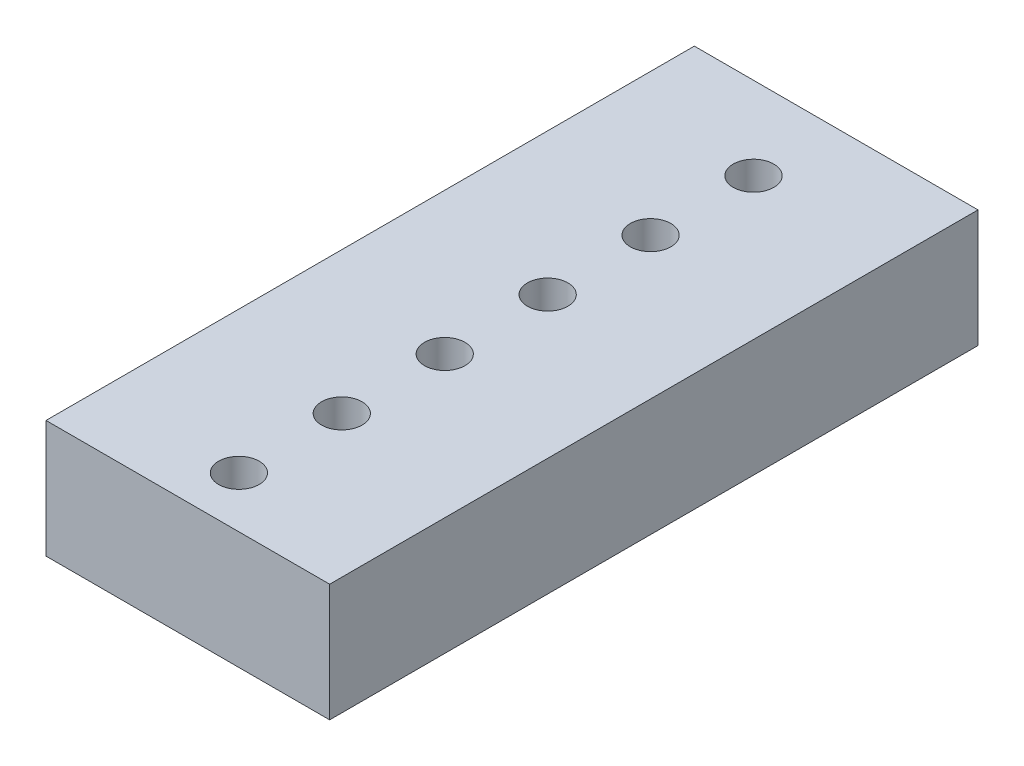
ISO-10303-21;
HEADER;
FILE_DESCRIPTION(('STEP AP214'),'2;1');
FILE_NAME('part.step','',(''),(''),'','','');
FILE_SCHEMA(('AUTOMOTIVE_DESIGN { 1 0 10303 214 1 1 1 1 }'));
ENDSEC;
DATA;
#1=APPLICATION_CONTEXT('core data for automotive mechanical design processes');
#2=APPLICATION_PROTOCOL_DEFINITION('international standard','automotive_design',2000,#1);
#3=PRODUCT_CONTEXT('',#1,'mechanical');
#4=PRODUCT('Part','Part','',(#3));
#5=PRODUCT_RELATED_PRODUCT_CATEGORY('part','',(#4));
#6=PRODUCT_DEFINITION_FORMATION('','',#4);
#7=PRODUCT_DEFINITION_CONTEXT('part definition',#1,'design');
#8=PRODUCT_DEFINITION('design','',#6,#7);
#9=PRODUCT_DEFINITION_SHAPE('','',#8);
#10=(LENGTH_UNIT() NAMED_UNIT(*) SI_UNIT(.MILLI.,.METRE.));
#11=(NAMED_UNIT(*) PLANE_ANGLE_UNIT() SI_UNIT($,.RADIAN.));
#12=(NAMED_UNIT(*) SI_UNIT($,.STERADIAN.) SOLID_ANGLE_UNIT());
#13=UNCERTAINTY_MEASURE_WITH_UNIT(LENGTH_MEASURE(1.E-05),#10,'distance_accuracy_value','');
#14=(GEOMETRIC_REPRESENTATION_CONTEXT(3) GLOBAL_UNCERTAINTY_ASSIGNED_CONTEXT((#13)) GLOBAL_UNIT_ASSIGNED_CONTEXT((#10,
#11,#12)) REPRESENTATION_CONTEXT('',''));
#15=CARTESIAN_POINT('',(0.,0.,0.));
#16=DIRECTION('',(0.,0.,1.));
#17=DIRECTION('',(1.,0.,0.));
#18=AXIS2_PLACEMENT_3D('',#15,#16,#17);
#19=CARTESIAN_POINT('',(0.,-1.45,6.74));
#20=DIRECTION('',(0.,1.,0.));
#21=DIRECTION('',(0.,0.,1.));
#22=AXIS2_PLACEMENT_3D('',#19,#20,#21);
#23=CYLINDRICAL_SURFACE('',#22,0.500000000000001);
#24=CARTESIAN_POINT('',(0.,-1.45,6.74));
#25=DIRECTION('',(0.,1.,0.));
#26=DIRECTION('',(0.,0.,1.));
#27=AXIS2_PLACEMENT_3D('',#24,#25,#26);
#28=CIRCLE('',#27,0.500000000000001);
#29=CARTESIAN_POINT('',(0.,-1.45,7.24));
#30=VERTEX_POINT('',#29);
#31=EDGE_CURVE('E41',#30,#30,#28,.T.);
#32=ORIENTED_EDGE('',*,*,#31,.F.);
#33=EDGE_LOOP('',(#32));
#34=FACE_BOUND('',#33,.T.);
#35=CARTESIAN_POINT('',(0.,1.45,6.74));
#36=DIRECTION('',(0.,1.,0.));
#37=DIRECTION('',(0.,0.,1.));
#38=AXIS2_PLACEMENT_3D('',#35,#36,#37);
#39=CIRCLE('',#38,0.500000000000001);
#40=CARTESIAN_POINT('',(0.,1.45,7.24));
#41=VERTEX_POINT('',#40);
#42=EDGE_CURVE('E11',#41,#41,#39,.T.);
#43=ORIENTED_EDGE('',*,*,#42,.T.);
#44=EDGE_LOOP('',(#43));
#45=FACE_BOUND('',#44,.T.);
#46=ADVANCED_FACE('F33',(#34,#45),#23,.F.);
#47=CARTESIAN_POINT('',(0.,-1.45,4.2));
#48=DIRECTION('',(0.,1.,0.));
#49=DIRECTION('',(0.,0.,1.));
#50=AXIS2_PLACEMENT_3D('',#47,#48,#49);
#51=CYLINDRICAL_SURFACE('',#50,0.500000000000001);
#52=CARTESIAN_POINT('',(0.,-1.45,4.2));
#53=DIRECTION('',(0.,1.,0.));
#54=DIRECTION('',(0.,0.,1.));
#55=AXIS2_PLACEMENT_3D('',#52,#53,#54);
#56=CIRCLE('',#55,0.500000000000001);
#57=CARTESIAN_POINT('',(0.,-1.45,4.7));
#58=VERTEX_POINT('',#57);
#59=EDGE_CURVE('E126',#58,#58,#56,.T.);
#60=ORIENTED_EDGE('',*,*,#59,.F.);
#61=EDGE_LOOP('',(#60));
#62=FACE_BOUND('',#61,.T.);
#63=CARTESIAN_POINT('',(0.,1.45,4.2));
#64=DIRECTION('',(0.,1.,0.));
#65=DIRECTION('',(0.,0.,1.));
#66=AXIS2_PLACEMENT_3D('',#63,#64,#65);
#67=CIRCLE('',#66,0.500000000000001);
#68=CARTESIAN_POINT('',(0.,1.45,4.7));
#69=VERTEX_POINT('',#68);
#70=EDGE_CURVE('E129',#69,#69,#67,.T.);
#71=ORIENTED_EDGE('',*,*,#70,.T.);
#72=EDGE_LOOP('',(#71));
#73=FACE_BOUND('',#72,.T.);
#74=ADVANCED_FACE('F138',(#62,#73),#51,.F.);
#75=CARTESIAN_POINT('',(0.,-1.45,1.66));
#76=DIRECTION('',(0.,1.,0.));
#77=DIRECTION('',(0.,0.,1.));
#78=AXIS2_PLACEMENT_3D('',#75,#76,#77);
#79=CYLINDRICAL_SURFACE('',#78,0.500000000000001);
#80=CARTESIAN_POINT('',(0.,-1.45,1.66));
#81=DIRECTION('',(0.,1.,0.));
#82=DIRECTION('',(0.,0.,1.));
#83=AXIS2_PLACEMENT_3D('',#80,#81,#82);
#84=CIRCLE('',#83,0.500000000000001);
#85=CARTESIAN_POINT('',(0.,-1.45,2.16));
#86=VERTEX_POINT('',#85);
#87=EDGE_CURVE('E120',#86,#86,#84,.T.);
#88=ORIENTED_EDGE('',*,*,#87,.F.);
#89=EDGE_LOOP('',(#88));
#90=FACE_BOUND('',#89,.T.);
#91=CARTESIAN_POINT('',(0.,1.45,1.66));
#92=DIRECTION('',(0.,1.,0.));
#93=DIRECTION('',(0.,0.,1.));
#94=AXIS2_PLACEMENT_3D('',#91,#92,#93);
#95=CIRCLE('',#94,0.500000000000001);
#96=CARTESIAN_POINT('',(0.,1.45,2.16));
#97=VERTEX_POINT('',#96);
#98=EDGE_CURVE('E123',#97,#97,#95,.T.);
#99=ORIENTED_EDGE('',*,*,#98,.T.);
#100=EDGE_LOOP('',(#99));
#101=FACE_BOUND('',#100,.T.);
#102=ADVANCED_FACE('F168',(#90,#101),#79,.F.);
#103=CARTESIAN_POINT('',(0.,-1.45,-0.880000000000003));
#104=DIRECTION('',(0.,1.,0.));
#105=DIRECTION('',(0.,0.,1.));
#106=AXIS2_PLACEMENT_3D('',#103,#104,#105);
#107=CYLINDRICAL_SURFACE('',#106,0.500000000000001);
#108=CARTESIAN_POINT('',(0.,-1.45,-0.880000000000003));
#109=DIRECTION('',(0.,1.,0.));
#110=DIRECTION('',(0.,0.,1.));
#111=AXIS2_PLACEMENT_3D('',#108,#109,#110);
#112=CIRCLE('',#111,0.500000000000001);
#113=CARTESIAN_POINT('',(0.,-1.45,-0.380000000000003));
#114=VERTEX_POINT('',#113);
#115=EDGE_CURVE('E112',#114,#114,#112,.T.);
#116=ORIENTED_EDGE('',*,*,#115,.F.);
#117=EDGE_LOOP('',(#116));
#118=FACE_BOUND('',#117,.T.);
#119=CARTESIAN_POINT('',(0.,1.45,-0.880000000000003));
#120=DIRECTION('',(0.,1.,0.));
#121=DIRECTION('',(0.,0.,1.));
#122=AXIS2_PLACEMENT_3D('',#119,#120,#121);
#123=CIRCLE('',#122,0.500000000000001);
#124=CARTESIAN_POINT('',(0.,1.45,-0.380000000000003));
#125=VERTEX_POINT('',#124);
#126=EDGE_CURVE('E117',#125,#125,#123,.T.);
#127=ORIENTED_EDGE('',*,*,#126,.T.);
#128=EDGE_LOOP('',(#127));
#129=FACE_BOUND('',#128,.T.);
#130=ADVANCED_FACE('F165',(#118,#129),#107,.F.);
#131=CARTESIAN_POINT('',(3.5,1.45,8.));
#132=DIRECTION('',(0.,0.,1.));
#133=DIRECTION('',(1.,0.,0.));
#134=AXIS2_PLACEMENT_3D('',#131,#132,#133);
#135=PLANE('',#134);
#136=DIRECTION('',(-1.,0.,0.));
#137=VECTOR('',#136,1.);
#138=CARTESIAN_POINT('',(3.5,-1.45,8.));
#139=LINE('',#138,#137);
#140=CARTESIAN_POINT('',(3.5,-1.45,8.));
#141=VERTEX_POINT('',#140);
#142=CARTESIAN_POINT('',(-3.5,-1.45,8.));
#143=VERTEX_POINT('',#142);
#144=EDGE_CURVE('E102',#141,#143,#139,.T.);
#145=ORIENTED_EDGE('',*,*,#144,.F.);
#146=DIRECTION('',(0.,-1.,0.));
#147=VECTOR('',#146,1.);
#148=CARTESIAN_POINT('',(3.5,1.45,8.));
#149=LINE('',#148,#147);
#150=CARTESIAN_POINT('',(3.5,1.45,8.));
#151=VERTEX_POINT('',#150);
#152=EDGE_CURVE('E49',#151,#141,#149,.T.);
#153=ORIENTED_EDGE('',*,*,#152,.F.);
#154=DIRECTION('',(-1.,0.,0.));
#155=VECTOR('',#154,1.);
#156=CARTESIAN_POINT('',(3.5,1.45,8.));
#157=LINE('',#156,#155);
#158=CARTESIAN_POINT('',(-3.5,1.45,8.));
#159=VERTEX_POINT('',#158);
#160=EDGE_CURVE('E95',#151,#159,#157,.T.);
#161=ORIENTED_EDGE('',*,*,#160,.T.);
#162=DIRECTION('',(0.,-1.,0.));
#163=VECTOR('',#162,1.);
#164=CARTESIAN_POINT('',(-3.5,1.45,8.));
#165=LINE('',#164,#163);
#166=EDGE_CURVE('E92',#159,#143,#165,.T.);
#167=ORIENTED_EDGE('',*,*,#166,.T.);
#168=EDGE_LOOP('',(#145,#153,#161,#167));
#169=FACE_BOUND('',#168,.T.);
#170=ADVANCED_FACE('F160',(#169),#135,.T.);
#171=CARTESIAN_POINT('',(3.5,1.45,-8.));
#172=DIRECTION('',(1.,0.,0.));
#173=DIRECTION('',(0.,0.,-1.));
#174=AXIS2_PLACEMENT_3D('',#171,#172,#173);
#175=PLANE('',#174);
#176=DIRECTION('',(0.,0.,1.));
#177=VECTOR('',#176,1.);
#178=CARTESIAN_POINT('',(3.5,-1.45,-8.));
#179=LINE('',#178,#177);
#180=CARTESIAN_POINT('',(3.5,-1.45,-8.));
#181=VERTEX_POINT('',#180);
#182=EDGE_CURVE('E97',#181,#141,#179,.T.);
#183=ORIENTED_EDGE('',*,*,#182,.F.);
#184=DIRECTION('',(0.,-1.,0.));
#185=VECTOR('',#184,1.);
#186=CARTESIAN_POINT('',(3.5,1.45,-8.));
#187=LINE('',#186,#185);
#188=CARTESIAN_POINT('',(3.5,1.45,-8.));
#189=VERTEX_POINT('',#188);
#190=EDGE_CURVE('E65',#189,#181,#187,.T.);
#191=ORIENTED_EDGE('',*,*,#190,.F.);
#192=DIRECTION('',(0.,0.,1.));
#193=VECTOR('',#192,1.);
#194=CARTESIAN_POINT('',(3.5,1.45,-8.));
#195=LINE('',#194,#193);
#196=EDGE_CURVE('E83',#189,#151,#195,.T.);
#197=ORIENTED_EDGE('',*,*,#196,.T.);
#198=ORIENTED_EDGE('',*,*,#152,.T.);
#199=EDGE_LOOP('',(#183,#191,#197,#198));
#200=FACE_BOUND('',#199,.T.);
#201=ADVANCED_FACE('F157',(#200),#175,.T.);
#202=CARTESIAN_POINT('',(3.5,1.45,-8.));
#203=DIRECTION('',(0.,0.,1.));
#204=DIRECTION('',(1.,0.,0.));
#205=AXIS2_PLACEMENT_3D('',#202,#203,#204);
#206=PLANE('',#205);
#207=DIRECTION('',(-1.,0.,0.));
#208=VECTOR('',#207,1.);
#209=CARTESIAN_POINT('',(3.5,-1.45,-8.));
#210=LINE('',#209,#208);
#211=CARTESIAN_POINT('',(-3.5,-1.45,-8.));
#212=VERTEX_POINT('',#211);
#213=EDGE_CURVE('E88',#181,#212,#210,.T.);
#214=ORIENTED_EDGE('',*,*,#213,.T.);
#215=DIRECTION('',(0.,-1.,0.));
#216=VECTOR('',#215,1.);
#217=CARTESIAN_POINT('',(-3.5,1.45,-8.));
#218=LINE('',#217,#216);
#219=CARTESIAN_POINT('',(-3.5,1.45,-8.));
#220=VERTEX_POINT('',#219);
#221=EDGE_CURVE('E86',#220,#212,#218,.T.);
#222=ORIENTED_EDGE('',*,*,#221,.F.);
#223=DIRECTION('',(-1.,0.,0.));
#224=VECTOR('',#223,1.);
#225=CARTESIAN_POINT('',(3.5,1.45,-8.));
#226=LINE('',#225,#224);
#227=EDGE_CURVE('E79',#189,#220,#226,.T.);
#228=ORIENTED_EDGE('',*,*,#227,.F.);
#229=ORIENTED_EDGE('',*,*,#190,.T.);
#230=EDGE_LOOP('',(#214,#222,#228,#229));
#231=FACE_BOUND('',#230,.T.);
#232=ADVANCED_FACE('F87',(#231),#206,.F.);
#233=CARTESIAN_POINT('',(-3.5,1.45,-8.));
#234=DIRECTION('',(1.,0.,0.));
#235=DIRECTION('',(0.,0.,-1.));
#236=AXIS2_PLACEMENT_3D('',#233,#234,#235);
#237=PLANE('',#236);
#238=DIRECTION('',(0.,0.,1.));
#239=VECTOR('',#238,1.);
#240=CARTESIAN_POINT('',(-3.5,-1.45,-8.));
#241=LINE('',#240,#239);
#242=EDGE_CURVE('E105',#212,#143,#241,.T.);
#243=ORIENTED_EDGE('',*,*,#242,.T.);
#244=ORIENTED_EDGE('',*,*,#166,.F.);
#245=DIRECTION('',(0.,0.,1.));
#246=VECTOR('',#245,1.);
#247=CARTESIAN_POINT('',(-3.5,1.45,-8.));
#248=LINE('',#247,#246);
#249=EDGE_CURVE('E76',#220,#159,#248,.T.);
#250=ORIENTED_EDGE('',*,*,#249,.F.);
#251=ORIENTED_EDGE('',*,*,#221,.T.);
#252=EDGE_LOOP('',(#243,#244,#250,#251));
#253=FACE_BOUND('',#252,.T.);
#254=ADVANCED_FACE('F94',(#253),#237,.F.);
#255=CARTESIAN_POINT('',(0.,1.45,0.));
#256=DIRECTION('',(0.,1.,0.));
#257=DIRECTION('',(0.,0.,1.));
#258=AXIS2_PLACEMENT_3D('',#255,#256,#257);
#259=PLANE('',#258);
#260=CARTESIAN_POINT('',(0.,1.45,-3.42));
#261=DIRECTION('',(0.,1.,0.));
#262=DIRECTION('',(0.,0.,1.));
#263=AXIS2_PLACEMENT_3D('',#260,#261,#262);
#264=CIRCLE('',#263,0.500000000000001);
#265=CARTESIAN_POINT('',(0.,1.45,-2.92));
#266=VERTEX_POINT('',#265);
#267=EDGE_CURVE('E253',#266,#266,#264,.T.);
#268=ORIENTED_EDGE('',*,*,#267,.F.);
#269=EDGE_LOOP('',(#268));
#270=FACE_BOUND('',#269,.T.);
#271=CARTESIAN_POINT('',(0.,1.45,-5.96));
#272=DIRECTION('',(0.,1.,0.));
#273=DIRECTION('',(0.,0.,1.));
#274=AXIS2_PLACEMENT_3D('',#271,#272,#273);
#275=CIRCLE('',#274,0.500000000000001);
#276=CARTESIAN_POINT('',(0.,1.45,-5.46));
#277=VERTEX_POINT('',#276);
#278=EDGE_CURVE('E254',#277,#277,#275,.T.);
#279=ORIENTED_EDGE('',*,*,#278,.F.);
#280=EDGE_LOOP('',(#279));
#281=FACE_BOUND('',#280,.T.);
#282=ORIENTED_EDGE('',*,*,#160,.F.);
#283=ORIENTED_EDGE('',*,*,#196,.F.);
#284=ORIENTED_EDGE('',*,*,#227,.T.);
#285=ORIENTED_EDGE('',*,*,#249,.T.);
#286=EDGE_LOOP('',(#282,#283,#284,#285));
#287=FACE_BOUND('',#286,.T.);
#288=ORIENTED_EDGE('',*,*,#126,.F.);
#289=EDGE_LOOP('',(#288));
#290=FACE_BOUND('',#289,.T.);
#291=ORIENTED_EDGE('',*,*,#98,.F.);
#292=EDGE_LOOP('',(#291));
#293=FACE_BOUND('',#292,.T.);
#294=ORIENTED_EDGE('',*,*,#70,.F.);
#295=EDGE_LOOP('',(#294));
#296=FACE_BOUND('',#295,.T.);
#297=ORIENTED_EDGE('',*,*,#42,.F.);
#298=EDGE_LOOP('',(#297));
#299=FACE_BOUND('',#298,.T.);
#300=ADVANCED_FACE('F81',(#270,#281,#287,#290,#293,#296,#299),#259,.T.);
#301=CARTESIAN_POINT('',(0.,-1.45,0.));
#302=DIRECTION('',(0.,1.,0.));
#303=DIRECTION('',(0.,0.,1.));
#304=AXIS2_PLACEMENT_3D('',#301,#302,#303);
#305=PLANE('',#304);
#306=CARTESIAN_POINT('',(0.,-1.45,-3.42));
#307=DIRECTION('',(0.,1.,0.));
#308=DIRECTION('',(0.,0.,1.));
#309=AXIS2_PLACEMENT_3D('',#306,#307,#308);
#310=CIRCLE('',#309,0.500000000000001);
#311=CARTESIAN_POINT('',(0.,-1.45,-2.92));
#312=VERTEX_POINT('',#311);
#313=EDGE_CURVE('E251',#312,#312,#310,.T.);
#314=ORIENTED_EDGE('',*,*,#313,.T.);
#315=EDGE_LOOP('',(#314));
#316=FACE_BOUND('',#315,.T.);
#317=CARTESIAN_POINT('',(0.,-1.45,-5.96));
#318=DIRECTION('',(0.,1.,0.));
#319=DIRECTION('',(0.,0.,1.));
#320=AXIS2_PLACEMENT_3D('',#317,#318,#319);
#321=CIRCLE('',#320,0.500000000000001);
#322=CARTESIAN_POINT('',(0.,-1.45,-5.46));
#323=VERTEX_POINT('',#322);
#324=EDGE_CURVE('E106',#323,#323,#321,.T.);
#325=ORIENTED_EDGE('',*,*,#324,.T.);
#326=EDGE_LOOP('',(#325));
#327=FACE_BOUND('',#326,.T.);
#328=ORIENTED_EDGE('',*,*,#144,.T.);
#329=ORIENTED_EDGE('',*,*,#242,.F.);
#330=ORIENTED_EDGE('',*,*,#213,.F.);
#331=ORIENTED_EDGE('',*,*,#182,.T.);
#332=EDGE_LOOP('',(#328,#329,#330,#331));
#333=FACE_BOUND('',#332,.T.);
#334=ORIENTED_EDGE('',*,*,#115,.T.);
#335=EDGE_LOOP('',(#334));
#336=FACE_BOUND('',#335,.T.);
#337=ORIENTED_EDGE('',*,*,#87,.T.);
#338=EDGE_LOOP('',(#337));
#339=FACE_BOUND('',#338,.T.);
#340=ORIENTED_EDGE('',*,*,#59,.T.);
#341=EDGE_LOOP('',(#340));
#342=FACE_BOUND('',#341,.T.);
#343=ORIENTED_EDGE('',*,*,#31,.T.);
#344=EDGE_LOOP('',(#343));
#345=FACE_BOUND('',#344,.T.);
#346=ADVANCED_FACE('F134',(#316,#327,#333,#336,#339,#342,#345),#305,.F.);
#347=CARTESIAN_POINT('',(0.,-1.45,-5.96));
#348=DIRECTION('',(0.,1.,0.));
#349=DIRECTION('',(0.,0.,1.));
#350=AXIS2_PLACEMENT_3D('',#347,#348,#349);
#351=CYLINDRICAL_SURFACE('',#350,0.500000000000001);
#352=ORIENTED_EDGE('',*,*,#324,.F.);
#353=EDGE_LOOP('',(#352));
#354=FACE_BOUND('',#353,.T.);
#355=ORIENTED_EDGE('',*,*,#278,.T.);
#356=EDGE_LOOP('',(#355));
#357=FACE_BOUND('',#356,.T.);
#358=ADVANCED_FACE('F148',(#354,#357),#351,.F.);
#359=CARTESIAN_POINT('',(0.,-1.45,-3.42));
#360=DIRECTION('',(0.,1.,0.));
#361=DIRECTION('',(0.,0.,1.));
#362=AXIS2_PLACEMENT_3D('',#359,#360,#361);
#363=CYLINDRICAL_SURFACE('',#362,0.500000000000001);
#364=ORIENTED_EDGE('',*,*,#313,.F.);
#365=EDGE_LOOP('',(#364));
#366=FACE_BOUND('',#365,.T.);
#367=ORIENTED_EDGE('',*,*,#267,.T.);
#368=EDGE_LOOP('',(#367));
#369=FACE_BOUND('',#368,.T.);
#370=ADVANCED_FACE('F216',(#366,#369),#363,.F.);
#371=CLOSED_SHELL('',(#46,#74,#102,#130,#170,#201,#232,#254,#300,#346,#358,#370));
#372=MANIFOLD_SOLID_BREP('B2',#371);
#373=ADVANCED_BREP_SHAPE_REPRESENTATION('',(#18,#372),#14);
#374=SHAPE_DEFINITION_REPRESENTATION(#9,#373);
ENDSEC;
END-ISO-10303-21;
